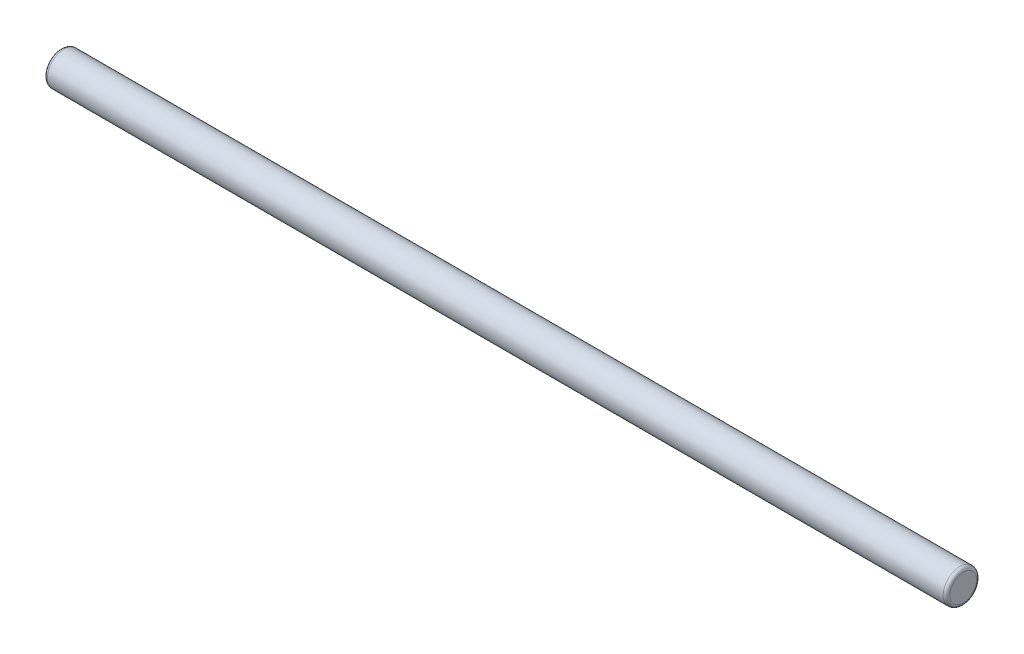
ISO-10303-21;
HEADER;
FILE_DESCRIPTION(('STEP AP214'),'2;1');
FILE_NAME('part.step','',(''),(''),'','','');
FILE_SCHEMA(('AUTOMOTIVE_DESIGN { 1 0 10303 214 1 1 1 1 }'));
ENDSEC;
DATA;
#1=APPLICATION_CONTEXT('core data for automotive mechanical design processes');
#2=APPLICATION_PROTOCOL_DEFINITION('international standard','automotive_design',2000,#1);
#3=PRODUCT_CONTEXT('',#1,'mechanical');
#4=PRODUCT('Part','Part','',(#3));
#5=PRODUCT_RELATED_PRODUCT_CATEGORY('part','',(#4));
#6=PRODUCT_DEFINITION_FORMATION('','',#4);
#7=PRODUCT_DEFINITION_CONTEXT('part definition',#1,'design');
#8=PRODUCT_DEFINITION('design','',#6,#7);
#9=PRODUCT_DEFINITION_SHAPE('','',#8);
#10=(LENGTH_UNIT() NAMED_UNIT(*) SI_UNIT(.MILLI.,.METRE.));
#11=(NAMED_UNIT(*) PLANE_ANGLE_UNIT() SI_UNIT($,.RADIAN.));
#12=(NAMED_UNIT(*) SI_UNIT($,.STERADIAN.) SOLID_ANGLE_UNIT());
#13=UNCERTAINTY_MEASURE_WITH_UNIT(LENGTH_MEASURE(1.E-05),#10,'distance_accuracy_value','');
#14=(GEOMETRIC_REPRESENTATION_CONTEXT(3) GLOBAL_UNCERTAINTY_ASSIGNED_CONTEXT((#13)) GLOBAL_UNIT_ASSIGNED_CONTEXT((#10,
#11,#12)) REPRESENTATION_CONTEXT('',''));
#15=CARTESIAN_POINT('',(0.,0.,0.));
#16=DIRECTION('',(0.,0.,1.));
#17=DIRECTION('',(1.,0.,0.));
#18=AXIS2_PLACEMENT_3D('',#15,#16,#17);
#19=CARTESIAN_POINT('',(270.,0.,0.));
#20=DIRECTION('',(-1.,0.,0.));
#21=DIRECTION('',(0.,0.,1.));
#22=AXIS2_PLACEMENT_3D('',#19,#20,#21);
#23=CYLINDRICAL_SURFACE('',#22,5.);
#24=CARTESIAN_POINT('',(269.,0.,0.));
#25=DIRECTION('',(1.,0.,0.));
#26=DIRECTION('',(0.,0.,-1.));
#27=AXIS2_PLACEMENT_3D('',#24,#25,#26);
#28=CIRCLE('',#27,5.);
#29=CARTESIAN_POINT('',(269.,0.,-5.));
#30=VERTEX_POINT('',#29);
#31=EDGE_CURVE('E38',#30,#30,#28,.F.);
#32=ORIENTED_EDGE('',*,*,#31,.T.);
#33=EDGE_LOOP('',(#32));
#34=FACE_BOUND('',#33,.T.);
#35=CARTESIAN_POINT('',(1.,0.,0.));
#36=DIRECTION('',(1.,0.,0.));
#37=DIRECTION('',(0.,0.,-1.));
#38=AXIS2_PLACEMENT_3D('',#35,#36,#37);
#39=CIRCLE('',#38,5.);
#40=CARTESIAN_POINT('',(1.,0.,-5.));
#41=VERTEX_POINT('',#40);
#42=EDGE_CURVE('E42',#41,#41,#39,.T.);
#43=ORIENTED_EDGE('',*,*,#42,.T.);
#44=EDGE_LOOP('',(#43));
#45=FACE_BOUND('',#44,.T.);
#46=ADVANCED_FACE('F31',(#34,#45),#23,.T.);
#47=CARTESIAN_POINT('',(270.,0.,0.));
#48=DIRECTION('',(1.,0.,0.));
#49=DIRECTION('',(0.,0.,-1.));
#50=AXIS2_PLACEMENT_3D('',#47,#48,#49);
#51=PLANE('',#50);
#52=CARTESIAN_POINT('',(270.,0.,0.));
#53=DIRECTION('',(1.,0.,0.));
#54=DIRECTION('',(0.,0.,-1.));
#55=AXIS2_PLACEMENT_3D('',#52,#53,#54);
#56=CIRCLE('',#55,4.);
#57=CARTESIAN_POINT('',(270.,0.,-4.));
#58=VERTEX_POINT('',#57);
#59=EDGE_CURVE('E46',#58,#58,#56,.T.);
#60=ORIENTED_EDGE('',*,*,#59,.T.);
#61=EDGE_LOOP('',(#60));
#62=FACE_BOUND('',#61,.T.);
#63=ADVANCED_FACE('F52',(#62),#51,.T.);
#64=CARTESIAN_POINT('',(0.,0.,0.));
#65=DIRECTION('',(1.,0.,0.));
#66=DIRECTION('',(0.,0.,-1.));
#67=AXIS2_PLACEMENT_3D('',#64,#65,#66);
#68=PLANE('',#67);
#69=CARTESIAN_POINT('',(0.,0.,0.));
#70=DIRECTION('',(1.,0.,0.));
#71=DIRECTION('',(0.,0.,-1.));
#72=AXIS2_PLACEMENT_3D('',#69,#70,#71);
#73=CIRCLE('',#72,4.);
#74=CARTESIAN_POINT('',(0.,0.,-4.));
#75=VERTEX_POINT('',#74);
#76=EDGE_CURVE('E10',#75,#75,#73,.F.);
#77=ORIENTED_EDGE('',*,*,#76,.T.);
#78=EDGE_LOOP('',(#77));
#79=FACE_BOUND('',#78,.T.);
#80=ADVANCED_FACE('F56',(#79),#68,.F.);
#81=CARTESIAN_POINT('',(269.,0.,0.));
#82=DIRECTION('',(1.,0.,0.));
#83=DIRECTION('',(0.,0.,-1.));
#84=AXIS2_PLACEMENT_3D('',#81,#82,#83);
#85=TOROIDAL_SURFACE('',#84,4.,1.);
#86=ORIENTED_EDGE('',*,*,#31,.F.);
#87=EDGE_LOOP('',(#86));
#88=FACE_BOUND('',#87,.T.);
#89=ORIENTED_EDGE('',*,*,#59,.F.);
#90=EDGE_LOOP('',(#89));
#91=FACE_BOUND('',#90,.T.);
#92=ADVANCED_FACE('F54',(#88,#91),#85,.T.);
#93=CARTESIAN_POINT('',(1.,0.,0.));
#94=DIRECTION('',(1.,0.,0.));
#95=DIRECTION('',(0.,0.,-1.));
#96=AXIS2_PLACEMENT_3D('',#93,#94,#95);
#97=TOROIDAL_SURFACE('',#96,4.,1.);
#98=ORIENTED_EDGE('',*,*,#76,.F.);
#99=EDGE_LOOP('',(#98));
#100=FACE_BOUND('',#99,.T.);
#101=ORIENTED_EDGE('',*,*,#42,.F.);
#102=EDGE_LOOP('',(#101));
#103=FACE_BOUND('',#102,.T.);
#104=ADVANCED_FACE('F33',(#100,#103),#97,.T.);
#105=CLOSED_SHELL('',(#46,#63,#80,#92,#104));
#106=MANIFOLD_SOLID_BREP('B2',#105);
#107=ADVANCED_BREP_SHAPE_REPRESENTATION('',(#18,#106),#14);
#108=SHAPE_DEFINITION_REPRESENTATION(#9,#107);
ENDSEC;
END-ISO-10303-21;
